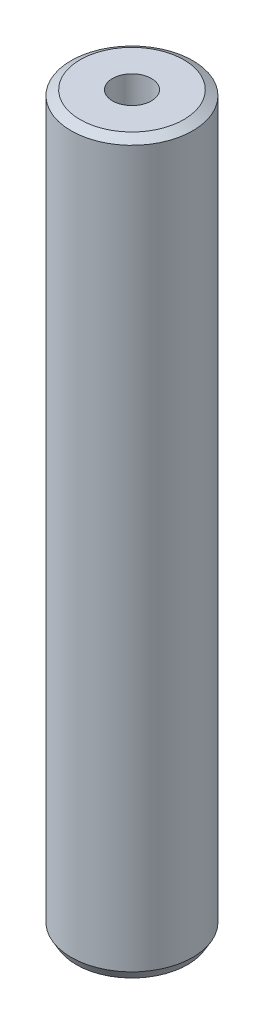
ISO-10303-21;
HEADER;
FILE_DESCRIPTION(('STEP AP214'),'2;1');
FILE_NAME('part.step','',(''),(''),'','','');
FILE_SCHEMA(('AUTOMOTIVE_DESIGN { 1 0 10303 214 1 1 1 1 }'));
ENDSEC;
DATA;
#1=APPLICATION_CONTEXT('core data for automotive mechanical design processes');
#2=APPLICATION_PROTOCOL_DEFINITION('international standard','automotive_design',2000,#1);
#3=PRODUCT_CONTEXT('',#1,'mechanical');
#4=PRODUCT('Part','Part','',(#3));
#5=PRODUCT_RELATED_PRODUCT_CATEGORY('part','',(#4));
#6=PRODUCT_DEFINITION_FORMATION('','',#4);
#7=PRODUCT_DEFINITION_CONTEXT('part definition',#1,'design');
#8=PRODUCT_DEFINITION('design','',#6,#7);
#9=PRODUCT_DEFINITION_SHAPE('','',#8);
#10=(LENGTH_UNIT() NAMED_UNIT(*) SI_UNIT(.MILLI.,.METRE.));
#11=(NAMED_UNIT(*) PLANE_ANGLE_UNIT() SI_UNIT($,.RADIAN.));
#12=(NAMED_UNIT(*) SI_UNIT($,.STERADIAN.) SOLID_ANGLE_UNIT());
#13=UNCERTAINTY_MEASURE_WITH_UNIT(LENGTH_MEASURE(1.E-05),#10,'distance_accuracy_value','');
#14=(GEOMETRIC_REPRESENTATION_CONTEXT(3) GLOBAL_UNCERTAINTY_ASSIGNED_CONTEXT((#13)) GLOBAL_UNIT_ASSIGNED_CONTEXT((#10,
#11,#12)) REPRESENTATION_CONTEXT('',''));
#15=CARTESIAN_POINT('',(0.,0.,0.));
#16=DIRECTION('',(0.,0.,1.));
#17=DIRECTION('',(1.,0.,0.));
#18=AXIS2_PLACEMENT_3D('',#15,#16,#17);
#19=CARTESIAN_POINT('',(0.,600.,0.));
#20=DIRECTION('',(0.,-1.,0.));
#21=DIRECTION('',(0.,0.,-1.));
#22=AXIS2_PLACEMENT_3D('',#19,#20,#21);
#23=CYLINDRICAL_SURFACE('',#22,50.);
#24=CARTESIAN_POINT('',(0.,595.742217176389,0.));
#25=DIRECTION('',(0.,1.,0.));
#26=DIRECTION('',(0.,0.,1.));
#27=AXIS2_PLACEMENT_3D('',#24,#25,#26);
#28=CIRCLE('',#27,50.);
#29=CARTESIAN_POINT('',(0.,595.742217176389,50.));
#30=VERTEX_POINT('',#29);
#31=EDGE_CURVE('E50',#30,#30,#28,.F.);
#32=ORIENTED_EDGE('',*,*,#31,.T.);
#33=EDGE_LOOP('',(#32));
#34=FACE_BOUND('',#33,.T.);
#35=CARTESIAN_POINT('',(0.,7.37469617808839,0.));
#36=DIRECTION('',(0.,1.,0.));
#37=DIRECTION('',(0.,0.,1.));
#38=AXIS2_PLACEMENT_3D('',#35,#36,#37);
#39=CIRCLE('',#38,50.);
#40=CARTESIAN_POINT('',(0.,7.37469617808839,50.));
#41=VERTEX_POINT('',#40);
#42=EDGE_CURVE('E51',#41,#41,#39,.T.);
#43=ORIENTED_EDGE('',*,*,#42,.T.);
#44=EDGE_LOOP('',(#43));
#45=FACE_BOUND('',#44,.T.);
#46=ADVANCED_FACE('F39',(#34,#45),#23,.T.);
#47=CARTESIAN_POINT('',(0.,600.,0.));
#48=DIRECTION('',(0.,1.,0.));
#49=DIRECTION('',(0.,0.,1.));
#50=AXIS2_PLACEMENT_3D('',#47,#48,#49);
#51=PLANE('',#50);
#52=CARTESIAN_POINT('',(0.,600.,0.));
#53=DIRECTION('',(0.,1.,0.));
#54=DIRECTION('',(0.,0.,1.));
#55=AXIS2_PLACEMENT_3D('',#52,#53,#54);
#56=CIRCLE('',#55,42.6253038219114);
#57=CARTESIAN_POINT('',(0.,600.,42.6253038219114));
#58=VERTEX_POINT('',#57);
#59=EDGE_CURVE('E54',#58,#58,#56,.T.);
#60=ORIENTED_EDGE('',*,*,#59,.T.);
#61=EDGE_LOOP('',(#60));
#62=FACE_BOUND('',#61,.T.);
#63=CARTESIAN_POINT('',(0.,600.,0.));
#64=DIRECTION('',(0.,1.,0.));
#65=DIRECTION('',(0.,0.,1.));
#66=AXIS2_PLACEMENT_3D('',#63,#64,#65);
#67=CIRCLE('',#66,16.010651598292);
#68=CARTESIAN_POINT('',(0.,600.,16.010651598292));
#69=VERTEX_POINT('',#68);
#70=EDGE_CURVE('E58',#69,#69,#67,.T.);
#71=ORIENTED_EDGE('',*,*,#70,.F.);
#72=EDGE_LOOP('',(#71));
#73=FACE_BOUND('',#72,.T.);
#74=ADVANCED_FACE('F69',(#62,#73),#51,.T.);
#75=CARTESIAN_POINT('',(0.,0.,0.));
#76=DIRECTION('',(0.,1.,0.));
#77=DIRECTION('',(0.,0.,1.));
#78=AXIS2_PLACEMENT_3D('',#75,#76,#77);
#79=PLANE('',#78);
#80=CARTESIAN_POINT('',(0.,0.,0.));
#81=DIRECTION('',(0.,1.,0.));
#82=DIRECTION('',(0.,0.,1.));
#83=AXIS2_PLACEMENT_3D('',#80,#81,#82);
#84=CIRCLE('',#83,45.742217176389);
#85=CARTESIAN_POINT('',(0.,0.,45.742217176389));
#86=VERTEX_POINT('',#85);
#87=EDGE_CURVE('E10',#86,#86,#84,.F.);
#88=ORIENTED_EDGE('',*,*,#87,.T.);
#89=EDGE_LOOP('',(#88));
#90=FACE_BOUND('',#89,.T.);
#91=CARTESIAN_POINT('',(0.,0.,0.));
#92=DIRECTION('',(0.,1.,0.));
#93=DIRECTION('',(0.,0.,1.));
#94=AXIS2_PLACEMENT_3D('',#91,#92,#93);
#95=CIRCLE('',#94,16.010651598292);
#96=CARTESIAN_POINT('',(0.,0.,16.010651598292));
#97=VERTEX_POINT('',#96);
#98=EDGE_CURVE('E63',#97,#97,#95,.T.);
#99=ORIENTED_EDGE('',*,*,#98,.T.);
#100=EDGE_LOOP('',(#99));
#101=FACE_BOUND('',#100,.T.);
#102=ADVANCED_FACE('F75',(#90,#101),#79,.F.);
#103=CARTESIAN_POINT('',(0.,600.,0.));
#104=DIRECTION('',(0.,-1.,0.));
#105=DIRECTION('',(0.,0.,-1.));
#106=AXIS2_PLACEMENT_3D('',#103,#104,#105);
#107=CYLINDRICAL_SURFACE('',#106,16.010651598292);
#108=ORIENTED_EDGE('',*,*,#70,.T.);
#109=EDGE_LOOP('',(#108));
#110=FACE_BOUND('',#109,.T.);
#111=ORIENTED_EDGE('',*,*,#98,.F.);
#112=EDGE_LOOP('',(#111));
#113=FACE_BOUND('',#112,.T.);
#114=ADVANCED_FACE('F70',(#110,#113),#107,.F.);
#115=CARTESIAN_POINT('',(0.,600.,0.));
#116=DIRECTION('',(0.,-1.,0.));
#117=DIRECTION('',(0.,0.,-1.));
#118=AXIS2_PLACEMENT_3D('',#115,#116,#117);
#119=CONICAL_SURFACE('',#118,42.6253038219114,1.04719755119659);
#120=ORIENTED_EDGE('',*,*,#31,.F.);
#121=EDGE_LOOP('',(#120));
#122=FACE_BOUND('',#121,.T.);
#123=ORIENTED_EDGE('',*,*,#59,.F.);
#124=EDGE_LOOP('',(#123));
#125=FACE_BOUND('',#124,.T.);
#126=ADVANCED_FACE('F81',(#122,#125),#119,.T.);
#127=CARTESIAN_POINT('',(0.,7.37469617808839,0.));
#128=DIRECTION('',(0.,1.,0.));
#129=DIRECTION('',(0.,0.,1.));
#130=AXIS2_PLACEMENT_3D('',#127,#128,#129);
#131=CONICAL_SURFACE('',#130,50.,0.523598775598297);
#132=ORIENTED_EDGE('',*,*,#87,.F.);
#133=EDGE_LOOP('',(#132));
#134=FACE_BOUND('',#133,.T.);
#135=ORIENTED_EDGE('',*,*,#42,.F.);
#136=EDGE_LOOP('',(#135));
#137=FACE_BOUND('',#136,.T.);
#138=ADVANCED_FACE('F45',(#134,#137),#131,.T.);
#139=CLOSED_SHELL('',(#46,#74,#102,#114,#126,#138));
#140=MANIFOLD_SOLID_BREP('B2',#139);
#141=ADVANCED_BREP_SHAPE_REPRESENTATION('',(#18,#140),#14);
#142=SHAPE_DEFINITION_REPRESENTATION(#9,#141);
ENDSEC;
END-ISO-10303-21;
